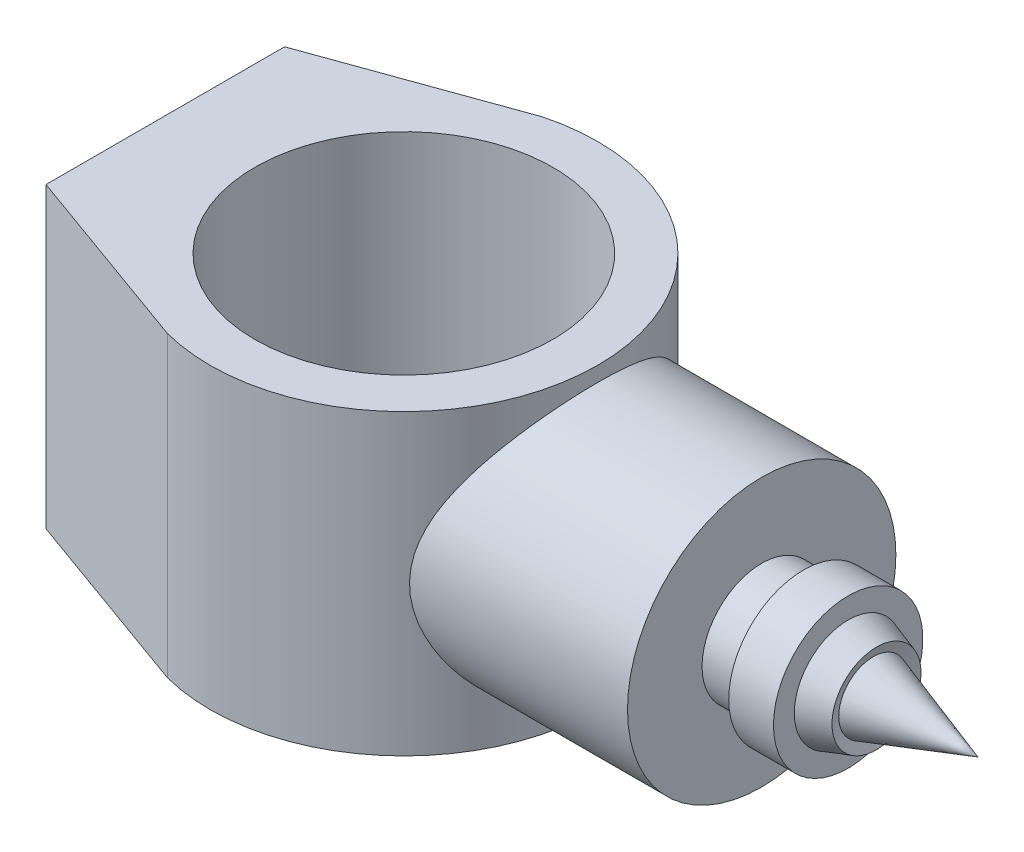
ISO-10303-21;
HEADER;
FILE_DESCRIPTION(('STEP AP214'),'2;1');
FILE_NAME('part.step','',(''),(''),'','','');
FILE_SCHEMA(('AUTOMOTIVE_DESIGN { 1 0 10303 214 1 1 1 1 }'));
ENDSEC;
DATA;
#1=APPLICATION_CONTEXT('core data for automotive mechanical design processes');
#2=APPLICATION_PROTOCOL_DEFINITION('international standard','automotive_design',2000,#1);
#3=PRODUCT_CONTEXT('',#1,'mechanical');
#4=PRODUCT('Part','Part','',(#3));
#5=PRODUCT_RELATED_PRODUCT_CATEGORY('part','',(#4));
#6=PRODUCT_DEFINITION_FORMATION('','',#4);
#7=PRODUCT_DEFINITION_CONTEXT('part definition',#1,'design');
#8=PRODUCT_DEFINITION('design','',#6,#7);
#9=PRODUCT_DEFINITION_SHAPE('','',#8);
#10=(LENGTH_UNIT() NAMED_UNIT(*) SI_UNIT(.MILLI.,.METRE.));
#11=(NAMED_UNIT(*) PLANE_ANGLE_UNIT() SI_UNIT($,.RADIAN.));
#12=(NAMED_UNIT(*) SI_UNIT($,.STERADIAN.) SOLID_ANGLE_UNIT());
#13=UNCERTAINTY_MEASURE_WITH_UNIT(LENGTH_MEASURE(1.E-05),#10,'distance_accuracy_value','');
#14=(GEOMETRIC_REPRESENTATION_CONTEXT(3) GLOBAL_UNCERTAINTY_ASSIGNED_CONTEXT((#13)) GLOBAL_UNIT_ASSIGNED_CONTEXT((#10,
#11,#12)) REPRESENTATION_CONTEXT('',''));
#15=CARTESIAN_POINT('',(0.,0.,0.));
#16=DIRECTION('',(0.,0.,1.));
#17=DIRECTION('',(1.,0.,0.));
#18=AXIS2_PLACEMENT_3D('',#15,#16,#17);
#19=CARTESIAN_POINT('',(0.,50.,0.));
#20=DIRECTION('',(0.,1.,0.));
#21=DIRECTION('',(0.,0.,1.));
#22=AXIS2_PLACEMENT_3D('',#19,#20,#21);
#23=PLANE('',#22);
#24=DIRECTION('',(-0.940878947226004,0.,0.338742980247393));
#25=VECTOR('',#24,1.);
#26=CARTESIAN_POINT('',(-80.,50.,-40.));
#27=LINE('',#26,#25);
#28=CARTESIAN_POINT('',(-16.4074233145552,50.,-62.8951227057949));
#29=VERTEX_POINT('',#28);
#30=CARTESIAN_POINT('',(-80.,50.,-40.));
#31=VERTEX_POINT('',#30);
#32=EDGE_CURVE('E186',#29,#31,#27,.T.);
#33=ORIENTED_EDGE('',*,*,#32,.T.);
#34=DIRECTION('',(0.,0.,1.));
#35=VECTOR('',#34,1.);
#36=CARTESIAN_POINT('',(-80.,50.,40.));
#37=LINE('',#36,#35);
#38=CARTESIAN_POINT('',(-80.,50.,40.));
#39=VERTEX_POINT('',#38);
#40=EDGE_CURVE('E88',#31,#39,#37,.T.);
#41=ORIENTED_EDGE('',*,*,#40,.T.);
#42=DIRECTION('',(0.940878947226004,0.,0.338742980247393));
#43=VECTOR('',#42,1.);
#44=CARTESIAN_POINT('',(-80.,50.,40.));
#45=LINE('',#44,#43);
#46=CARTESIAN_POINT('',(-16.4074233145552,50.,62.8951227057949));
#47=VERTEX_POINT('',#46);
#48=EDGE_CURVE('E182',#39,#47,#45,.T.);
#49=ORIENTED_EDGE('',*,*,#48,.T.);
#50=CARTESIAN_POINT('',(0.,50.,0.));
#51=DIRECTION('',(0.,1.,0.));
#52=DIRECTION('',(0.,0.,1.));
#53=AXIS2_PLACEMENT_3D('',#50,#51,#52);
#54=CIRCLE('',#53,65.);
#55=EDGE_CURVE('E57',#47,#29,#54,.T.);
#56=ORIENTED_EDGE('',*,*,#55,.T.);
#57=EDGE_LOOP('',(#33,#41,#49,#56));
#58=FACE_BOUND('',#57,.T.);
#59=CARTESIAN_POINT('',(0.,50.,0.));
#60=DIRECTION('',(0.,1.,0.));
#61=DIRECTION('',(0.,0.,1.));
#62=AXIS2_PLACEMENT_3D('',#59,#60,#61);
#63=CIRCLE('',#62,50.);
#64=CARTESIAN_POINT('',(0.,50.,50.));
#65=VERTEX_POINT('',#64);
#66=EDGE_CURVE('E196',#65,#65,#63,.T.);
#67=ORIENTED_EDGE('',*,*,#66,.F.);
#68=EDGE_LOOP('',(#67));
#69=FACE_BOUND('',#68,.T.);
#70=ADVANCED_FACE('F40',(#58,#69),#23,.T.);
#71=CARTESIAN_POINT('',(0.,-50.,0.));
#72=DIRECTION('',(0.,1.,0.));
#73=DIRECTION('',(0.,0.,1.));
#74=AXIS2_PLACEMENT_3D('',#71,#72,#73);
#75=PLANE('',#74);
#76=DIRECTION('',(-0.940878947226004,0.,0.338742980247393));
#77=VECTOR('',#76,1.);
#78=CARTESIAN_POINT('',(-80.,-50.,-40.));
#79=LINE('',#78,#77);
#80=CARTESIAN_POINT('',(-16.4074233145552,-50.,-62.8951227057949));
#81=VERTEX_POINT('',#80);
#82=CARTESIAN_POINT('',(-80.,-50.,-40.));
#83=VERTEX_POINT('',#82);
#84=EDGE_CURVE('E180',#81,#83,#79,.T.);
#85=ORIENTED_EDGE('',*,*,#84,.F.);
#86=CARTESIAN_POINT('',(0.,-50.,0.));
#87=DIRECTION('',(0.,1.,0.));
#88=DIRECTION('',(0.,0.,1.));
#89=AXIS2_PLACEMENT_3D('',#86,#87,#88);
#90=CIRCLE('',#89,65.);
#91=CARTESIAN_POINT('',(-16.4074233145552,-50.,62.8951227057949));
#92=VERTEX_POINT('',#91);
#93=EDGE_CURVE('E81',#92,#81,#90,.T.);
#94=ORIENTED_EDGE('',*,*,#93,.F.);
#95=DIRECTION('',(0.940878947226004,0.,0.338742980247393));
#96=VECTOR('',#95,1.);
#97=CARTESIAN_POINT('',(-80.,-50.,40.));
#98=LINE('',#97,#96);
#99=CARTESIAN_POINT('',(-80.,-50.,40.));
#100=VERTEX_POINT('',#99);
#101=EDGE_CURVE('E75',#100,#92,#98,.T.);
#102=ORIENTED_EDGE('',*,*,#101,.F.);
#103=DIRECTION('',(0.,0.,1.));
#104=VECTOR('',#103,1.);
#105=CARTESIAN_POINT('',(-80.,-50.,40.));
#106=LINE('',#105,#104);
#107=EDGE_CURVE('E175',#83,#100,#106,.T.);
#108=ORIENTED_EDGE('',*,*,#107,.F.);
#109=EDGE_LOOP('',(#85,#94,#102,#108));
#110=FACE_BOUND('',#109,.T.);
#111=CARTESIAN_POINT('',(0.,-50.,0.));
#112=DIRECTION('',(0.,1.,0.));
#113=DIRECTION('',(0.,0.,1.));
#114=AXIS2_PLACEMENT_3D('',#111,#112,#113);
#115=CIRCLE('',#114,50.);
#116=CARTESIAN_POINT('',(0.,-50.,50.));
#117=VERTEX_POINT('',#116);
#118=EDGE_CURVE('E198',#117,#117,#115,.T.);
#119=ORIENTED_EDGE('',*,*,#118,.T.);
#120=EDGE_LOOP('',(#119));
#121=FACE_BOUND('',#120,.T.);
#122=ADVANCED_FACE('F155',(#110,#121),#75,.F.);
#123=CARTESIAN_POINT('',(-80.,50.,-40.));
#124=DIRECTION('',(0.338742980247393,0.,0.940878947226004));
#125=DIRECTION('',(0.940878947226004,0.,-0.338742980247393));
#126=AXIS2_PLACEMENT_3D('',#123,#124,#125);
#127=PLANE('',#126);
#128=ORIENTED_EDGE('',*,*,#84,.T.);
#129=DIRECTION('',(0.,-1.,0.));
#130=VECTOR('',#129,1.);
#131=CARTESIAN_POINT('',(-80.,50.,-40.));
#132=LINE('',#131,#130);
#133=EDGE_CURVE('E11',#31,#83,#132,.T.);
#134=ORIENTED_EDGE('',*,*,#133,.F.);
#135=ORIENTED_EDGE('',*,*,#32,.F.);
#136=DIRECTION('',(0.,-1.,0.));
#137=VECTOR('',#136,1.);
#138=CARTESIAN_POINT('',(-16.4074233145552,50.,-62.8951227057949));
#139=LINE('',#138,#137);
#140=EDGE_CURVE('E190',#29,#81,#139,.T.);
#141=ORIENTED_EDGE('',*,*,#140,.T.);
#142=EDGE_LOOP('',(#128,#134,#135,#141));
#143=FACE_BOUND('',#142,.T.);
#144=ADVANCED_FACE('F42',(#143),#127,.F.);
#145=CARTESIAN_POINT('',(-80.,50.,40.));
#146=DIRECTION('',(1.,0.,0.));
#147=DIRECTION('',(0.,0.,-1.));
#148=AXIS2_PLACEMENT_3D('',#145,#146,#147);
#149=PLANE('',#148);
#150=ORIENTED_EDGE('',*,*,#107,.T.);
#151=DIRECTION('',(0.,-1.,0.));
#152=VECTOR('',#151,1.);
#153=CARTESIAN_POINT('',(-80.,50.,40.));
#154=LINE('',#153,#152);
#155=EDGE_CURVE('E49',#39,#100,#154,.T.);
#156=ORIENTED_EDGE('',*,*,#155,.F.);
#157=ORIENTED_EDGE('',*,*,#40,.F.);
#158=ORIENTED_EDGE('',*,*,#133,.T.);
#159=EDGE_LOOP('',(#150,#156,#157,#158));
#160=FACE_BOUND('',#159,.T.);
#161=ADVANCED_FACE('F169',(#160),#149,.F.);
#162=CARTESIAN_POINT('',(-80.,50.,40.));
#163=DIRECTION('',(0.338742980247393,0.,-0.940878947226004));
#164=DIRECTION('',(-0.940878947226004,0.,-0.338742980247393));
#165=AXIS2_PLACEMENT_3D('',#162,#163,#164);
#166=PLANE('',#165);
#167=ORIENTED_EDGE('',*,*,#101,.T.);
#168=DIRECTION('',(0.,-1.,0.));
#169=VECTOR('',#168,1.);
#170=CARTESIAN_POINT('',(-16.4074233145552,50.,62.8951227057949));
#171=LINE('',#170,#169);
#172=EDGE_CURVE('E183',#47,#92,#171,.T.);
#173=ORIENTED_EDGE('',*,*,#172,.F.);
#174=ORIENTED_EDGE('',*,*,#48,.F.);
#175=ORIENTED_EDGE('',*,*,#155,.T.);
#176=EDGE_LOOP('',(#167,#173,#174,#175));
#177=FACE_BOUND('',#176,.T.);
#178=ADVANCED_FACE('F166',(#177),#166,.F.);
#179=CARTESIAN_POINT('',(0.,50.,0.));
#180=DIRECTION('',(0.,-1.,0.));
#181=DIRECTION('',(0.,0.,-1.));
#182=AXIS2_PLACEMENT_3D('',#179,#180,#181);
#183=CYLINDRICAL_SURFACE('',#182,65.);
#184=CARTESIAN_POINT('',(46.9041575982343,0.,-45.));
#185=CARTESIAN_POINT('',(46.9041496496715,0.542263220033968,-45.0000044023999));
#186=CARTESIAN_POINT('',(46.913568908199,1.08446303689199,-44.9901956428668));
#187=CARTESIAN_POINT('',(46.9510977786156,2.16755974927585,-44.9510315434934));
#188=CARTESIAN_POINT('',(46.9792082048512,2.70845658700228,-44.9216753520005));
#189=CARTESIAN_POINT('',(47.0537594963817,3.78762028318266,-44.8435795370597));
#190=CARTESIAN_POINT('',(47.1002018249815,4.32588692821388,-44.7948383662451));
#191=CARTESIAN_POINT('',(47.2107970257243,5.39854129569276,-44.6782609193227));
#192=CARTESIAN_POINT('',(47.2749521559208,5.93292851466554,-44.6104222086113));
#193=CARTESIAN_POINT('',(47.4930879945893,7.53031935098505,-44.3785131411881));
#194=CARTESIAN_POINT('',(47.6726245282284,8.58594655467546,-44.1861673529054));
#195=CARTESIAN_POINT('',(48.0914510532684,10.6691351642075,-43.7299394083376));
#196=CARTESIAN_POINT('',(48.3307425029001,11.6966958844488,-43.4660555062566));
#197=CARTESIAN_POINT('',(48.8565963668031,13.7076137214716,-42.8740926665452));
#198=CARTESIAN_POINT('',(49.1426125904817,14.6913316117963,-42.5467481475018));
#199=CARTESIAN_POINT('',(49.7542254307509,16.6229553923871,-41.8298803073717));
#200=CARTESIAN_POINT('',(50.0798214389102,17.570861832863,-41.4403579420709));
#201=CARTESIAN_POINT('',(50.7614905658211,19.4287355543507,-40.6024954528526));
#202=CARTESIAN_POINT('',(51.1175611167704,20.3387060222797,-40.1541602828428));
#203=CARTESIAN_POINT('',(51.8518334884602,22.1194642792719,-39.2013926083376));
#204=CARTESIAN_POINT('',(52.2300368673614,22.9902493020101,-38.6969561520305));
#205=CARTESIAN_POINT('',(53.0666524668326,24.8366216790887,-37.543582055924));
#206=CARTESIAN_POINT('',(53.5277482435913,25.804773412422,-36.8846696960417));
#207=CARTESIAN_POINT('',(54.458696978114,27.6842193951234,-35.4957672221003));
#208=CARTESIAN_POINT('',(54.9285505773748,28.5955094580385,-34.7657718846491));
#209=CARTESIAN_POINT('',(55.867478714254,30.3600679479332,-33.2359920203533));
#210=CARTESIAN_POINT('',(56.33655177139,31.2132696407418,-32.436129556942));
#211=CARTESIAN_POINT('',(57.2640149058537,32.8576968679126,-30.7691807472108));
#212=CARTESIAN_POINT('',(57.7224042667133,33.6489182541144,-29.9020899092069));
#213=CARTESIAN_POINT('',(58.6920821561721,35.2883175903838,-27.9571678221931));
#214=CARTESIAN_POINT('',(59.1999495308119,36.1250393615687,-26.8679239056401));
#215=CARTESIAN_POINT('',(60.1757923070609,37.7029210550097,-24.6047121291381));
#216=CARTESIAN_POINT('',(60.6437605761107,38.4440639031969,-23.4307291898038));
#217=CARTESIAN_POINT('',(61.3053074244693,39.4767033741893,-21.6119285940945));
#218=CARTESIAN_POINT('',(61.5189717359482,39.8075611337002,-20.996413773624));
#219=CARTESIAN_POINT('',(61.9314217265619,40.4420472518005,-19.7466881459133));
#220=CARTESIAN_POINT('',(62.1302095068843,40.7456794569804,-19.1124799966566));
#221=CARTESIAN_POINT('',(62.5113037680476,41.3244541572008,-17.8265666697973));
#222=CARTESIAN_POINT('',(62.6936147249584,41.599604392582,-17.1748663068769));
#223=CARTESIAN_POINT('',(63.0403012974886,42.1202716127319,-15.8551558190576));
#224=CARTESIAN_POINT('',(63.2046784973549,42.3657912152394,-15.1871471412064));
#225=CARTESIAN_POINT('',(63.5869616841829,42.9344232645632,-13.5180083001904));
#226=CARTESIAN_POINT('',(63.7936366358918,43.2396497706999,-12.5081038476276));
#227=CARTESIAN_POINT('',(64.1609988858375,43.779823633289,-10.4616860617985));
#228=CARTESIAN_POINT('',(64.3216942033186,44.0147832452165,-9.42517740294007));
#229=CARTESIAN_POINT('',(64.5937107840553,44.4113534042391,-7.33245841288299));
#230=CARTESIAN_POINT('',(64.7050633585387,44.5730104681618,-6.27626102023791));
#231=CARTESIAN_POINT('',(64.876091009391,44.8209242663905,-4.15083985557727));
#232=CARTESIAN_POINT('',(64.9357643469801,44.9071784637214,-3.08161564649372));
#233=CARTESIAN_POINT('',(65.0021364658006,45.003099411919,-0.936087194337004));
#234=CARTESIAN_POINT('',(65.0087366329852,45.0126235925545,0.140226511210831));
#235=CARTESIAN_POINT('',(64.9685505134827,44.954565837567,2.28975827156439));
#236=CARTESIAN_POINT('',(64.9217644261679,44.8869841898979,3.36297633791586));
#237=CARTESIAN_POINT('',(64.7758600835833,44.6756966721471,5.49852450193018));
#238=CARTESIAN_POINT('',(64.6767294259506,44.5319727611231,6.56085195836896));
#239=CARTESIAN_POINT('',(64.4283359607471,44.1704393171426,8.66682322528598));
#240=CARTESIAN_POINT('',(64.279073064626,43.952629653326,9.7104670027592));
#241=CARTESIAN_POINT('',(63.9372809834785,43.4512230241986,11.7503587054767));
#242=CARTESIAN_POINT('',(63.7457400006043,43.169124499351,12.7471426066849));
#243=CARTESIAN_POINT('',(63.3213922078692,42.5400120479616,14.7108965132453));
#244=CARTESIAN_POINT('',(63.0885862658902,42.1929994866792,15.6778671451263));
#245=CARTESIAN_POINT('',(62.5858949770697,41.4375884326521,17.5775799934));
#246=CARTESIAN_POINT('',(62.3160072196501,41.0291859489692,18.5103199795617));
#247=CARTESIAN_POINT('',(61.7437059245989,40.1546327923994,20.3379434898807));
#248=CARTESIAN_POINT('',(61.4412904532505,39.6884786860271,21.232824758991));
#249=CARTESIAN_POINT('',(60.7731034923155,38.6464427968589,23.0802977388641));
#250=CARTESIAN_POINT('',(60.4040317118412,38.0641166053607,24.0280617043868));
#251=CARTESIAN_POINT('',(59.6382600881718,36.8368301216631,25.8703168206944));
#252=CARTESIAN_POINT('',(59.2415584909973,36.191865852084,26.7648045827323));
#253=CARTESIAN_POINT('',(58.4270234660594,34.8425988814496,28.4991513127813));
#254=CARTESIAN_POINT('',(58.0091699539542,34.1382393438595,29.3389565607212));
#255=CARTESIAN_POINT('',(57.1597554656806,32.6740453222771,30.9612807332357));
#256=CARTESIAN_POINT('',(56.7281938089378,31.9142080815195,31.7437968071556));
#257=CARTESIAN_POINT('',(55.7824152366184,30.2038288101227,33.3821271730831));
#258=CARTESIAN_POINT('',(55.2669714713171,29.2432068558902,34.2267418367398));
#259=CARTESIAN_POINT('',(54.2397975504909,27.2522129723406,35.8322871214641));
#260=CARTESIAN_POINT('',(53.7280681614852,26.2218270751954,36.5932009037928));
#261=CARTESIAN_POINT('',(52.7223709959144,24.0941345748267,38.0278685287763));
#262=CARTESIAN_POINT('',(52.2283997141877,22.9968412946007,38.7016396409403));
#263=CARTESIAN_POINT('',(51.2737378085495,20.737498439319,39.9578005331571));
#264=CARTESIAN_POINT('',(50.8130371677153,19.5754685429889,40.5402178798592));
#265=CARTESIAN_POINT('',(50.0443454847495,17.4688225691713,41.4830356848764));
#266=CARTESIAN_POINT('',(49.7258511632829,16.5369838529003,41.8634935183028));
#267=CARTESIAN_POINT('',(49.1272599826791,14.6389296595616,42.5643598048688));
#268=CARTESIAN_POINT('',(48.8471586480428,13.6727182059169,42.8847752587947));
#269=CARTESIAN_POINT('',(48.3347114372366,11.7106597395224,43.4615282318587));
#270=CARTESIAN_POINT('',(48.1022908460203,10.714861935575,43.7179661413248));
#271=CARTESIAN_POINT('',(47.6933795156547,8.69674438612959,44.1637130645002));
#272=CARTESIAN_POINT('',(47.5168881517166,7.67442493704454,44.3530228281049));
#273=CARTESIAN_POINT('',(47.2991222340667,6.12159103572385,44.5847967399117));
#274=CARTESIAN_POINT('',(47.2341602778733,5.5981285413628,44.6535637174983));
#275=CARTESIAN_POINT('',(47.1211797900218,4.54732361160912,44.7727735699926));
#276=CARTESIAN_POINT('',(47.0731591532394,4.0199816665952,44.8232187215891));
#277=CARTESIAN_POINT('',(46.9946617963115,2.96249197915653,44.9055116929201));
#278=CARTESIAN_POINT('',(46.9641870447368,2.43234392863051,44.9373574258875));
#279=CARTESIAN_POINT('',(46.9211807439966,1.37058715501267,44.9822606514934));
#280=CARTESIAN_POINT('',(46.908646950129,0.838978622990841,44.9953204945495));
#281=CARTESIAN_POINT('',(46.9016811256407,-0.224443282066023,45.002581404975));
#282=CARTESIAN_POINT('',(46.907247635532,-0.756256635128243,44.9967839928678));
#283=CARTESIAN_POINT('',(46.9364044151399,-1.81882204254287,44.9663694078626));
#284=CARTESIAN_POINT('',(46.9599938743193,-2.34957414354624,44.9417530812981));
#285=CARTESIAN_POINT('',(47.0248886231195,-3.40873620498109,44.8738461314226));
#286=CARTESIAN_POINT('',(47.0661918763054,-3.93714642758951,44.8305576547189));
#287=CARTESIAN_POINT('',(47.1659893357347,-4.99056190364479,44.7255477987864));
#288=CARTESIAN_POINT('',(47.2244866179672,-5.51556653064381,44.6638231213139));
#289=CARTESIAN_POINT('',(47.4074084645363,-6.94806511713192,44.4698403792512));
#290=CARTESIAN_POINT('',(47.548581765513,-7.85102574728642,44.3191924178924));
#291=CARTESIAN_POINT('',(47.8761127827507,-9.63818033513148,43.9651644675785));
#292=CARTESIAN_POINT('',(48.0624746603227,-10.5223725563229,43.7617796220864));
#293=CARTESIAN_POINT('',(48.3716360076031,-11.8319722381728,43.4189871591535));
#294=CARTESIAN_POINT('',(48.4796869673543,-12.2659344372668,43.2983681646062));
#295=CARTESIAN_POINT('',(48.7048800324634,-13.1277668086684,43.0448998825417));
#296=CARTESIAN_POINT('',(48.8220198337972,-13.555638492586,42.9120536930423));
#297=CARTESIAN_POINT('',(49.186029754211,-14.829982967162,42.4955353566406));
#298=CARTESIAN_POINT('',(49.4454609109319,-15.6670619287002,42.1939158299611));
#299=CARTESIAN_POINT('',(50.1188533069733,-17.6973459679745,41.3942769247961));
#300=CARTESIAN_POINT('',(50.5485626885018,-18.8750897591785,40.8701617526908));
#301=CARTESIAN_POINT('',(51.4491805850901,-21.1691312160748,39.7304608703936));
#302=CARTESIAN_POINT('',(51.9201051960706,-22.2854045957589,39.1148393577893));
#303=CARTESIAN_POINT('',(52.8879679083619,-24.4557142402778,37.795938910858));
#304=CARTESIAN_POINT('',(53.3849471359886,-25.5096461586506,37.0925188162126));
#305=CARTESIAN_POINT('',(54.3899821322348,-27.5510302284287,35.6024921637553));
#306=CARTESIAN_POINT('',(54.8980366389582,-28.5384899016854,34.8158950440547));
#307=CARTESIAN_POINT('',(55.9211854971921,-30.460664153144,33.1480680527009));
#308=CARTESIAN_POINT('',(56.4362522669018,-31.3941930559955,32.265453896383));
#309=CARTESIAN_POINT('',(57.4523680617411,-33.1861277879224,30.4193302197096));
#310=CARTESIAN_POINT('',(57.9534160493415,-34.0445280666867,29.4558147328559));
#311=CARTESIAN_POINT('',(58.9290472039158,-35.680002891402,27.4519157250799));
#312=CARTESIAN_POINT('',(59.4036646471775,-36.4571839701277,26.4116360304329));
#313=CARTESIAN_POINT('',(60.3157385015404,-37.925176104846,24.2565444183071));
#314=CARTESIAN_POINT('',(60.7532023060788,-38.6160043577025,23.1417474087772));
#315=CARTESIAN_POINT('',(61.5108027690337,-39.7963279944309,21.0346559998949));
#316=CARTESIAN_POINT('',(61.8383275580495,-40.3001742670285,20.0530382007555));
#317=CARTESIAN_POINT('',(62.4537845231471,-41.2383388761095,18.0451359612786));
#318=CARTESIAN_POINT('',(62.7417206569315,-41.6726641633627,17.0188559993695));
#319=CARTESIAN_POINT('',(63.2720338096412,-42.4669003384949,14.9269369301005));
#320=CARTESIAN_POINT('',(63.5144306966973,-42.8268436850481,13.8613152309225));
#321=CARTESIAN_POINT('',(63.948505752659,-43.468000704936,11.6964591578509));
#322=CARTESIAN_POINT('',(64.1401834104763,-43.7492135849199,10.5972244453696));
#323=CARTESIAN_POINT('',(64.4692060825706,-44.2301877948398,8.36655603301038));
#324=CARTESIAN_POINT('',(64.6062470342426,-44.4294934811677,7.2349786920182));
#325=CARTESIAN_POINT('',(64.8210358495573,-44.7412503459552,4.95429714036763));
#326=CARTESIAN_POINT('',(64.89878353064,-44.8537012569947,3.80519287575608));
#327=CARTESIAN_POINT('',(64.9929410704761,-44.989830060574,1.49951076035019));
#328=CARTESIAN_POINT('',(65.009366476577,-45.0135304544874,0.3429348783753));
#329=CARTESIAN_POINT('',(64.9804787940221,-44.9718009805298,-1.96778150388794));
#330=CARTESIAN_POINT('',(64.9351698567588,-44.9063771059166,-3.12192216270852));
#331=CARTESIAN_POINT('',(64.7909213588445,-44.6975224919059,-5.31324780711175));
#332=CARTESIAN_POINT('',(64.6972351943993,-44.5617289644248,-6.35152161956746));
#333=CARTESIAN_POINT('',(64.4618780543791,-44.2193305877586,-8.41070940446718));
#334=CARTESIAN_POINT('',(64.3202105370907,-44.0127308419641,-9.43162462247512));
#335=CARTESIAN_POINT('',(63.9917608143223,-43.5313265924708,-11.4498985042781));
#336=CARTESIAN_POINT('',(63.8049733133432,-43.2565140828883,-12.4472543879415));
#337=CARTESIAN_POINT('',(63.3898969296381,-42.6418852975766,-14.4128458332136));
#338=CARTESIAN_POINT('',(63.1616059555138,-42.3020657460375,-15.3810799244816));
#339=CARTESIAN_POINT('',(62.6575582365232,-41.5457857909008,-17.3227354435299));
#340=CARTESIAN_POINT('',(62.3802426172771,-41.1267602278654,-18.2947508731833));
#341=CARTESIAN_POINT('',(61.790199663807,-40.2261668017153,-20.1981220220099));
#342=CARTESIAN_POINT('',(61.4774717966912,-39.7445979974189,-21.1294771290247));
#343=CARTESIAN_POINT('',(60.8219323199509,-38.7228745455818,-22.9483603034586));
#344=CARTESIAN_POINT('',(60.4791197541947,-38.1827180359169,-23.8358869765499));
#345=CARTESIAN_POINT('',(59.7688244581653,-37.0473829032546,-25.5648408793752));
#346=CARTESIAN_POINT('',(59.4013387639288,-36.4521976664498,-26.4062625484225));
#347=CARTESIAN_POINT('',(58.806246486324,-35.4719052555474,-27.6965129317763));
#348=CARTESIAN_POINT('',(58.5849314099908,-35.1039272677588,-28.1614011317828));
#349=CARTESIAN_POINT('',(58.1370843387709,-34.3513026323038,-29.0746979626639));
#350=CARTESIAN_POINT('',(57.9105533862498,-33.9666593018021,-29.5231098405391));
#351=CARTESIAN_POINT('',(57.2246633445519,-32.7882707177015,-30.8434985552431));
#352=CARTESIAN_POINT('',(56.7590115080618,-31.9700741277807,-31.6906189389114));
#353=CARTESIAN_POINT('',(55.8193591395913,-30.2705037959563,-33.3179225539817));
#354=CARTESIAN_POINT('',(55.3453432327477,-29.389001960016,-34.0979626253898));
#355=CARTESIAN_POINT('',(54.3996718478405,-27.5668435260693,-35.5872701357242));
#356=CARTESIAN_POINT('',(53.9280164889781,-26.6261839726578,-36.2965340342236));
#357=CARTESIAN_POINT('',(52.92864778764,-24.5437559829223,-37.7417526743181));
#358=CARTESIAN_POINT('',(52.4030009873048,-23.3928573138245,-38.4660518408684));
#359=CARTESIAN_POINT('',(51.3867969194596,-21.0179763843795,-39.8134336622156));
#360=CARTESIAN_POINT('',(50.8962498240961,-19.7939731248431,-40.4364870412174));
#361=CARTESIAN_POINT('',(49.9722307548099,-17.2796077430274,-41.5729613728324));
#362=CARTESIAN_POINT('',(49.5385923978556,-15.9894551315477,-42.0867047791572));
#363=CARTESIAN_POINT('',(48.9470227335994,-14.007446803018,-42.7700813291331));
#364=CARTESIAN_POINT('',(48.7596725864257,-13.3390907140087,-42.9833067961598));
#365=CARTESIAN_POINT('',(48.4074390531642,-11.9877248064362,-43.3796043152814));
#366=CARTESIAN_POINT('',(48.2425521116756,-11.3047173266996,-43.562681140162));
#367=CARTESIAN_POINT('',(47.9014278944419,-9.75925629947305,-43.9378226543048));
#368=CARTESIAN_POINT('',(47.7320233302204,-8.89320698246194,-44.1214302045676));
#369=CARTESIAN_POINT('',(47.4373665759083,-7.1446474632921,-44.4380821296475));
#370=CARTESIAN_POINT('',(47.3121044117909,-6.26214102714999,-44.5711379272237));
#371=CARTESIAN_POINT('',(47.1099623095141,-4.48619302789549,-44.7847422146358));
#372=CARTESIAN_POINT('',(47.033032591909,-3.59276368505823,-44.8653447311984));
#373=CARTESIAN_POINT('',(46.9301330299368,-1.7994986777957,-44.972973966973));
#374=CARTESIAN_POINT('',(46.9041707855947,-0.899662078025694,-44.9999926960338));
#375=CARTESIAN_POINT('',(46.9041575982343,0.,-45.));
#376=B_SPLINE_CURVE_WITH_KNOTS('',3,(#184,#185,#186,#187,#188,#189,#190,#191,#192,#193,#194,
#195,#196,#197,#198,#199,#200,#201,#202,#203,#204,#205,#206,#207,#208,#209,#210,#211,#212,#213,
#214,#215,#216,#217,#218,#219,#220,#221,#222,#223,#224,#225,#226,#227,#228,#229,#230,#231,#232,
#233,#234,#235,#236,#237,#238,#239,#240,#241,#242,#243,#244,#245,#246,#247,#248,#249,#250,#251,
#252,#253,#254,#255,#256,#257,#258,#259,#260,#261,#262,#263,#264,#265,#266,#267,#268,#269,#270,
#271,#272,#273,#274,#275,#276,#277,#278,#279,#280,#281,#282,#283,#284,#285,#286,#287,#288,#289,
#290,#291,#292,#293,#294,#295,#296,#297,#298,#299,#300,#301,#302,#303,#304,#305,#306,#307,#308,
#309,#310,#311,#312,#313,#314,#315,#316,#317,#318,#319,#320,#321,#322,#323,#324,#325,#326,#327,
#328,#329,#330,#331,#332,#333,#334,#335,#336,#337,#338,#339,#340,#341,#342,#343,#344,#345,#346,
#347,#348,#349,#350,#351,#352,#353,#354,#355,#356,#357,#358,#359,#360,#361,#362,#363,#364,#365,
#366,#367,#368,#369,#370,#371,#372,#373,#374,#375),.UNSPECIFIED.,.T.,.F.,(4,2,2,2,2,2,2,2,2,2,2,
2,2,2,2,2,2,2,2,2,2,2,2,2,2,2,2,2,2,2,2,2,2,2,2,2,2,2,2,2,2,2,2,2,2,2,2,2,2,2,2,2,2,2,2,2,2,2,2,
2,2,2,2,2,2,2,2,2,2,2,2,2,2,2,2,2,2,2,2,2,2,2,2,2,2,2,2,2,2,2,2,2,2,2,2,4),(0.,1.62650916673032,
3.25308920269147,4.87979910317665,6.50671647481014,9.76537301153435,13.024109078755,
16.2471693159373,19.4701800136212,22.692919405452,25.9158859531289,29.6882085724611,
33.4608086029537,37.2376720542595,41.0147880643923,45.402247278015,49.7904891779737,
51.9819606864533,54.1731220811247,56.3636864275412,58.5540571051428,61.7756055753234,
64.996591836738,68.215531232473,71.434578927207,74.6596064821154,77.8846219931133,
81.1104019725526,84.336187649822,87.4933348780261,90.6504157131876,93.8077018779389,
96.9651758417893,100.477740931914,103.99052920818,107.50671794091,111.023081517094,
115.155898896862,119.289546191993,123.422373041759,127.553950372371,130.718433823976,
133.88254807509,137.04166568096,140.200747994892,141.796074798261,143.391203296825,
144.986510726917,146.581618540964,148.176597739333,149.771505211717,151.366229377518,
152.961239011177,155.736890846186,158.512798381669,159.902126572961,161.291103712635,
164.069449505065,168.140137318282,172.212422025731,176.291340485777,180.369796605901,
184.517758047139,188.66602567097,192.808781978049,196.950711950795,200.400211366493,
203.849365682464,207.297011668627,210.744692394758,214.211300839715,217.677919958091,
221.143660107222,224.609167210415,227.759436039302,230.909477858858,234.05988956231,
237.210460061935,240.489824538472,243.769238370227,247.048756463887,250.328669230801,
252.226828468542,254.124611606164,257.920216113285,261.723729791781,265.527433637647,
269.895538624233,274.264904434285,278.621196643643,280.798650823356,282.975759961533,
285.677275681091,288.378180598045,291.076299169153,293.77482004021),.UNSPECIFIED.);
#377=CARTESIAN_POINT('',(46.9041575982343,0.,-45.));
#378=VERTEX_POINT('',#377);
#379=EDGE_CURVE('E121',#378,#378,#376,.T.);
#380=ORIENTED_EDGE('',*,*,#379,.F.);
#381=EDGE_LOOP('',(#380));
#382=FACE_BOUND('',#381,.T.);
#383=ORIENTED_EDGE('',*,*,#93,.T.);
#384=ORIENTED_EDGE('',*,*,#140,.F.);
#385=ORIENTED_EDGE('',*,*,#55,.F.);
#386=ORIENTED_EDGE('',*,*,#172,.T.);
#387=EDGE_LOOP('',(#383,#384,#385,#386));
#388=FACE_BOUND('',#387,.T.);
#389=ADVANCED_FACE('F152',(#382,#388),#183,.T.);
#390=CARTESIAN_POINT('',(0.,50.,0.));
#391=DIRECTION('',(0.,-1.,0.));
#392=DIRECTION('',(0.,0.,-1.));
#393=AXIS2_PLACEMENT_3D('',#390,#391,#392);
#394=CYLINDRICAL_SURFACE('',#393,50.);
#395=ORIENTED_EDGE('',*,*,#66,.T.);
#396=EDGE_LOOP('',(#395));
#397=FACE_BOUND('',#396,.T.);
#398=ORIENTED_EDGE('',*,*,#118,.F.);
#399=EDGE_LOOP('',(#398));
#400=FACE_BOUND('',#399,.T.);
#401=ADVANCED_FACE('F142',(#397,#400),#394,.F.);
#402=CARTESIAN_POINT('',(-80.002,0.,0.));
#403=DIRECTION('',(1.,0.,0.));
#404=DIRECTION('',(0.,0.,-1.));
#405=AXIS2_PLACEMENT_3D('',#402,#403,#404);
#406=CYLINDRICAL_SURFACE('',#405,45.);
#407=CARTESIAN_POINT('',(120.,0.,0.));
#408=DIRECTION('',(1.,0.,0.));
#409=DIRECTION('',(0.,0.,-1.));
#410=AXIS2_PLACEMENT_3D('',#407,#408,#409);
#411=CIRCLE('',#410,45.);
#412=CARTESIAN_POINT('',(120.,0.,-45.));
#413=VERTEX_POINT('',#412);
#414=EDGE_CURVE('E129',#413,#413,#411,.T.);
#415=ORIENTED_EDGE('',*,*,#414,.F.);
#416=EDGE_LOOP('',(#415));
#417=FACE_BOUND('',#416,.T.);
#418=ORIENTED_EDGE('',*,*,#379,.T.);
#419=EDGE_LOOP('',(#418));
#420=FACE_BOUND('',#419,.T.);
#421=ADVANCED_FACE('F131',(#417,#420),#406,.T.);
#422=CARTESIAN_POINT('',(120.,0.,0.));
#423=DIRECTION('',(1.,0.,0.));
#424=DIRECTION('',(0.,0.,-1.));
#425=AXIS2_PLACEMENT_3D('',#422,#423,#424);
#426=PLANE('',#425);
#427=CARTESIAN_POINT('',(120.,0.,0.));
#428=DIRECTION('',(-1.,0.,0.));
#429=DIRECTION('',(0.,0.,1.));
#430=AXIS2_PLACEMENT_3D('',#427,#428,#429);
#431=CIRCLE('',#430,20.);
#432=CARTESIAN_POINT('',(120.,0.,20.));
#433=VERTEX_POINT('',#432);
#434=EDGE_CURVE('E118',#433,#433,#431,.T.);
#435=ORIENTED_EDGE('',*,*,#434,.T.);
#436=EDGE_LOOP('',(#435));
#437=FACE_BOUND('',#436,.T.);
#438=ORIENTED_EDGE('',*,*,#414,.T.);
#439=EDGE_LOOP('',(#438));
#440=FACE_BOUND('',#439,.T.);
#441=ADVANCED_FACE('F139',(#437,#440),#426,.T.);
#442=CARTESIAN_POINT('',(0.,0.,0.));
#443=DIRECTION('',(-1.,0.,0.));
#444=DIRECTION('',(0.,0.,1.));
#445=AXIS2_PLACEMENT_3D('',#442,#443,#444);
#446=CYLINDRICAL_SURFACE('',#445,20.);
#447=CARTESIAN_POINT('',(134.,0.,0.));
#448=DIRECTION('',(-1.,0.,0.));
#449=DIRECTION('',(0.,0.,1.));
#450=AXIS2_PLACEMENT_3D('',#447,#448,#449);
#451=CIRCLE('',#450,20.);
#452=CARTESIAN_POINT('',(134.,0.,20.));
#453=VERTEX_POINT('',#452);
#454=EDGE_CURVE('E115',#453,#453,#451,.T.);
#455=ORIENTED_EDGE('',*,*,#454,.T.);
#456=EDGE_LOOP('',(#455));
#457=FACE_BOUND('',#456,.T.);
#458=ORIENTED_EDGE('',*,*,#434,.F.);
#459=EDGE_LOOP('',(#458));
#460=FACE_BOUND('',#459,.T.);
#461=ADVANCED_FACE('F137',(#457,#460),#446,.T.);
#462=CARTESIAN_POINT('',(134.,0.,20.));
#463=DIRECTION('',(-1.,0.,0.));
#464=DIRECTION('',(0.,0.,1.));
#465=AXIS2_PLACEMENT_3D('',#462,#463,#464);
#466=PLANE('',#465);
#467=CARTESIAN_POINT('',(134.,0.,0.));
#468=DIRECTION('',(-1.,0.,0.));
#469=DIRECTION('',(0.,0.,1.));
#470=AXIS2_PLACEMENT_3D('',#467,#468,#469);
#471=CIRCLE('',#470,25.0513061846149);
#472=CARTESIAN_POINT('',(134.,0.,25.0513061846149));
#473=VERTEX_POINT('',#472);
#474=EDGE_CURVE('E112',#473,#473,#471,.T.);
#475=ORIENTED_EDGE('',*,*,#474,.T.);
#476=EDGE_LOOP('',(#475));
#477=FACE_BOUND('',#476,.T.);
#478=ORIENTED_EDGE('',*,*,#454,.F.);
#479=EDGE_LOOP('',(#478));
#480=FACE_BOUND('',#479,.T.);
#481=ADVANCED_FACE('F147',(#477,#480),#466,.T.);
#482=CARTESIAN_POINT('',(0.,0.,0.));
#483=DIRECTION('',(-1.,0.,0.));
#484=DIRECTION('',(0.,0.,1.));
#485=AXIS2_PLACEMENT_3D('',#482,#483,#484);
#486=CYLINDRICAL_SURFACE('',#485,25.0513061846149);
#487=CARTESIAN_POINT('',(149.,0.,0.));
#488=DIRECTION('',(-1.,0.,0.));
#489=DIRECTION('',(0.,0.,1.));
#490=AXIS2_PLACEMENT_3D('',#487,#488,#489);
#491=CIRCLE('',#490,25.0513061846149);
#492=CARTESIAN_POINT('',(149.,0.,25.0513061846149));
#493=VERTEX_POINT('',#492);
#494=EDGE_CURVE('E109',#493,#493,#491,.T.);
#495=ORIENTED_EDGE('',*,*,#494,.T.);
#496=EDGE_LOOP('',(#495));
#497=FACE_BOUND('',#496,.T.);
#498=ORIENTED_EDGE('',*,*,#474,.F.);
#499=EDGE_LOOP('',(#498));
#500=FACE_BOUND('',#499,.T.);
#501=ADVANCED_FACE('F266',(#497,#500),#486,.T.);
#502=CARTESIAN_POINT('',(149.,0.,25.0513061846149));
#503=DIRECTION('',(1.,0.,0.));
#504=DIRECTION('',(0.,0.,-1.));
#505=AXIS2_PLACEMENT_3D('',#502,#503,#504);
#506=PLANE('',#505);
#507=CARTESIAN_POINT('',(149.,0.,0.));
#508=DIRECTION('',(-1.,0.,0.));
#509=DIRECTION('',(0.,0.,1.));
#510=AXIS2_PLACEMENT_3D('',#507,#508,#509);
#511=CIRCLE('',#510,18.0513061846149);
#512=CARTESIAN_POINT('',(149.,0.,18.0513061846149));
#513=VERTEX_POINT('',#512);
#514=EDGE_CURVE('E104',#513,#513,#511,.T.);
#515=ORIENTED_EDGE('',*,*,#514,.T.);
#516=EDGE_LOOP('',(#515));
#517=FACE_BOUND('',#516,.T.);
#518=ORIENTED_EDGE('',*,*,#494,.F.);
#519=EDGE_LOOP('',(#518));
#520=FACE_BOUND('',#519,.T.);
#521=ADVANCED_FACE('F274',(#517,#520),#506,.T.);
#522=CARTESIAN_POINT('',(149.,0.,0.));
#523=DIRECTION('',(-1.,0.,0.));
#524=DIRECTION('',(0.,0.,1.));
#525=AXIS2_PLACEMENT_3D('',#522,#523,#524);
#526=CONICAL_SURFACE('',#525,18.0513061846149,0.317770811177449);
#527=CARTESIAN_POINT('',(158.499342872539,0.,0.));
#528=DIRECTION('',(-1.,0.,0.));
#529=DIRECTION('',(0.,0.,1.));
#530=AXIS2_PLACEMENT_3D('',#527,#528,#529);
#531=CIRCLE('',#530,14.9268086266159);
#532=CARTESIAN_POINT('',(158.499342872539,0.,14.9268086266159));
#533=VERTEX_POINT('',#532);
#534=EDGE_CURVE('E101',#533,#533,#531,.T.);
#535=ORIENTED_EDGE('',*,*,#534,.T.);
#536=EDGE_LOOP('',(#535));
#537=FACE_BOUND('',#536,.T.);
#538=ORIENTED_EDGE('',*,*,#514,.F.);
#539=EDGE_LOOP('',(#538));
#540=FACE_BOUND('',#539,.T.);
#541=ADVANCED_FACE('F284',(#537,#540),#526,.T.);
#542=CARTESIAN_POINT('',(158.499342872539,0.,0.));
#543=DIRECTION('',(1.,0.,0.));
#544=DIRECTION('',(0.,0.,-1.));
#545=AXIS2_PLACEMENT_3D('',#542,#543,#544);
#546=CONICAL_SURFACE('',#545,14.9268086266159,1.25302551561745);
#547=CARTESIAN_POINT('',(157.392152324633,0.,0.));
#548=DIRECTION('',(-1.,0.,0.));
#549=DIRECTION('',(0.,0.,1.));
#550=AXIS2_PLACEMENT_3D('',#547,#548,#549);
#551=CIRCLE('',#550,11.5606409645964);
#552=CARTESIAN_POINT('',(157.392152324633,0.,11.5606409645964));
#553=VERTEX_POINT('',#552);
#554=EDGE_CURVE('E99',#553,#553,#551,.T.);
#555=ORIENTED_EDGE('',*,*,#554,.T.);
#556=EDGE_LOOP('',(#555));
#557=FACE_BOUND('',#556,.T.);
#558=ORIENTED_EDGE('',*,*,#534,.F.);
#559=EDGE_LOOP('',(#558));
#560=FACE_BOUND('',#559,.T.);
#561=ADVANCED_FACE('F95',(#557,#560),#546,.F.);
#562=CARTESIAN_POINT('',(157.392152324633,0.,0.));
#563=DIRECTION('',(-1.,0.,0.));
#564=DIRECTION('',(0.,0.,1.));
#565=AXIS2_PLACEMENT_3D('',#562,#563,#564);
#566=CONICAL_SURFACE('',#565,11.5606409645964,0.317770811177449);
#567=CARTESIAN_POINT('',(192.539720953027,0.,0.));
#568=VERTEX_POINT('',#567);
#569=VERTEX_LOOP('',#568);
#570=FACE_BOUND('',#569,.T.);
#571=ORIENTED_EDGE('',*,*,#554,.F.);
#572=EDGE_LOOP('',(#571));
#573=FACE_BOUND('',#572,.T.);
#574=ADVANCED_FACE('F92',(#570,#573),#566,.T.);
#575=CLOSED_SHELL('',(#70,#122,#144,#161,#178,#389,#401,#421,#441,#461,#481,#501,#521,#541,#561,#574));
#576=MANIFOLD_SOLID_BREP('B2',#575);
#577=ADVANCED_BREP_SHAPE_REPRESENTATION('',(#18,#576),#14);
#578=SHAPE_DEFINITION_REPRESENTATION(#9,#577);
ENDSEC;
END-ISO-10303-21;
